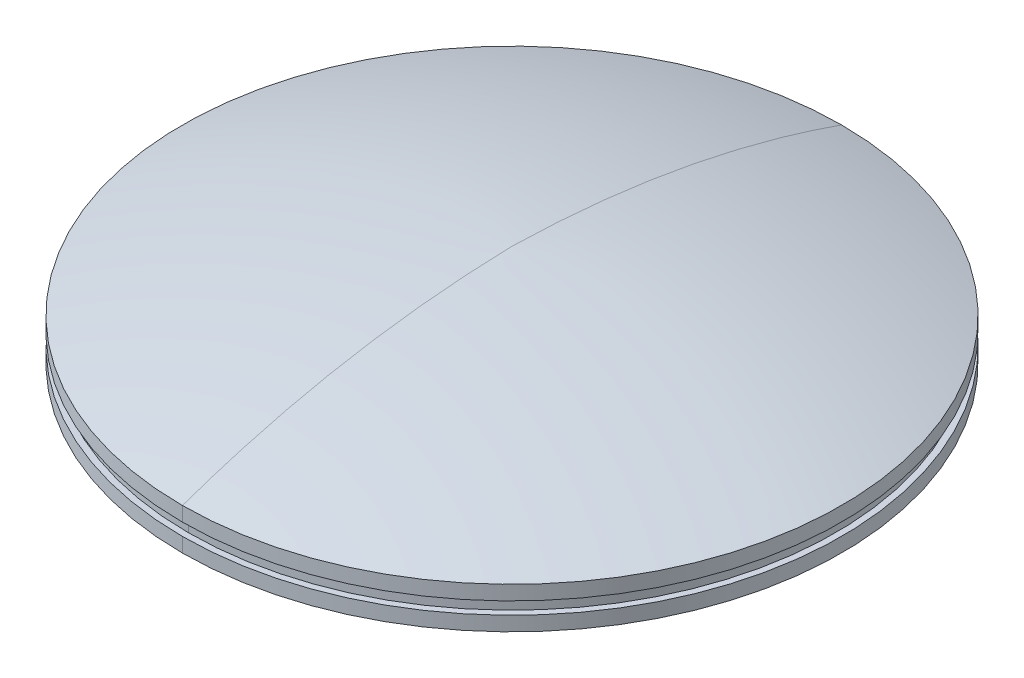
ISO-10303-21;
HEADER;
FILE_DESCRIPTION(('STEP AP214'),'2;1');
FILE_NAME('part.step','',(''),(''),'','','');
FILE_SCHEMA(('AUTOMOTIVE_DESIGN { 1 0 10303 214 1 1 1 1 }'));
ENDSEC;
DATA;
#1=APPLICATION_CONTEXT('core data for automotive mechanical design processes');
#2=APPLICATION_PROTOCOL_DEFINITION('international standard','automotive_design',2000,#1);
#3=PRODUCT_CONTEXT('',#1,'mechanical');
#4=PRODUCT('Part','Part','',(#3));
#5=PRODUCT_RELATED_PRODUCT_CATEGORY('part','',(#4));
#6=PRODUCT_DEFINITION_FORMATION('','',#4);
#7=PRODUCT_DEFINITION_CONTEXT('part definition',#1,'design');
#8=PRODUCT_DEFINITION('design','',#6,#7);
#9=PRODUCT_DEFINITION_SHAPE('','',#8);
#10=(LENGTH_UNIT() NAMED_UNIT(*) SI_UNIT(.MILLI.,.METRE.));
#11=(NAMED_UNIT(*) PLANE_ANGLE_UNIT() SI_UNIT($,.RADIAN.));
#12=(NAMED_UNIT(*) SI_UNIT($,.STERADIAN.) SOLID_ANGLE_UNIT());
#13=UNCERTAINTY_MEASURE_WITH_UNIT(LENGTH_MEASURE(1.E-05),#10,'distance_accuracy_value','');
#14=(GEOMETRIC_REPRESENTATION_CONTEXT(3) GLOBAL_UNCERTAINTY_ASSIGNED_CONTEXT((#13)) GLOBAL_UNIT_ASSIGNED_CONTEXT((#10,
#11,#12)) REPRESENTATION_CONTEXT('',''));
#15=CARTESIAN_POINT('',(0.,0.,0.));
#16=DIRECTION('',(0.,0.,1.));
#17=DIRECTION('',(1.,0.,0.));
#18=AXIS2_PLACEMENT_3D('',#15,#16,#17);
#19=CARTESIAN_POINT('',(0.,39.9,-36.1149923829614));
#20=CARTESIAN_POINT('',(0.,39.9,-36.1149923829614));
#21=CARTESIAN_POINT('',(0.,39.9,-36.1149923829614));
#22=CARTESIAN_POINT('',(0.,39.9,-36.1149923829614));
#23=CARTESIAN_POINT('',(0.,39.703769318367,-44.4473896628763));
#24=CARTESIAN_POINT('',(16.6647945598297,39.703769318367,-44.4473896628762));
#25=CARTESIAN_POINT('',(16.6647945598297,39.703769318367,-27.7825951030466));
#26=CARTESIAN_POINT('',(0.,39.703769318367,-27.7825951030466));
#27=CARTESIAN_POINT('',(0.,37.,-52.1149923829614));
#28=CARTESIAN_POINT('',(32.,37.,-52.1149923829614));
#29=CARTESIAN_POINT('',(32.,37.,-20.1149923829614));
#30=CARTESIAN_POINT('',(0.,37.,-20.1149923829614));
#31=(BOUNDED_SURFACE() B_SPLINE_SURFACE(2,3,((#19,#20,#21,#22),(#23,#24,#25,#26),(#27,#28,#29,
#30)),.UNSPECIFIED.,.F.,.F.,.F.) B_SPLINE_SURFACE_WITH_KNOTS((3,3),(4,4),(0.,1.),(0.,1.),
.UNSPECIFIED.) GEOMETRIC_REPRESENTATION_ITEM() RATIONAL_B_SPLINE_SURFACE(((1.,0.333333333333334,
0.333333333333334,1.),(1.,0.333333333333334,0.333333333333334,1.),(1.,0.333333333333334,
0.333333333333334,1.))) REPRESENTATION_ITEM('') SURFACE());
#32=CARTESIAN_POINT('',(0.,39.9,-36.1149923829614));
#33=CARTESIAN_POINT('',(0.,39.703769318367,-44.4473896628763));
#34=CARTESIAN_POINT('',(0.,37.,-52.1149923829614));
#35=(BOUNDED_CURVE() B_SPLINE_CURVE(2,(#32,#33,#34),.UNSPECIFIED.,.F.,
.F.) B_SPLINE_CURVE_WITH_KNOTS((3,3),(0.,1.),
.UNSPECIFIED.) CURVE() GEOMETRIC_REPRESENTATION_ITEM() RATIONAL_B_SPLINE_CURVE((1.,1.,1.)) REPRESENTATION_ITEM(''));
#36=CARTESIAN_POINT('',(0.,39.9,-36.1149923829614));
#37=VERTEX_POINT('',#36);
#38=CARTESIAN_POINT('',(0.,37.,-52.1149923829614));
#39=VERTEX_POINT('',#38);
#40=EDGE_CURVE('E48',#37,#39,#35,.T.);
#41=CARTESIAN_POINT('',(0.,39.9,-36.1149923829614));
#42=CARTESIAN_POINT('',(0.,39.703769318367,-27.7825951030466));
#43=CARTESIAN_POINT('',(0.,37.,-20.1149923829614));
#44=(BOUNDED_CURVE() B_SPLINE_CURVE(2,(#41,#42,#43),.UNSPECIFIED.,.F.,
.F.) B_SPLINE_CURVE_WITH_KNOTS((3,3),(0.,1.),
.UNSPECIFIED.) CURVE() GEOMETRIC_REPRESENTATION_ITEM() RATIONAL_B_SPLINE_CURVE((1.,1.,1.)) REPRESENTATION_ITEM(''));
#45=CARTESIAN_POINT('',(0.,37.,-20.1149923829614));
#46=VERTEX_POINT('',#45);
#47=EDGE_CURVE('E11',#37,#46,#44,.T.);
#48=CARTESIAN_POINT('',(0.,37.,-36.1149923829614));
#49=DIRECTION('',(0.,-1.,0.));
#50=DIRECTION('',(0.,0.,-1.));
#51=AXIS2_PLACEMENT_3D('',#48,#49,#50);
#52=CIRCLE('',#51,16.);
#53=EDGE_CURVE('E57',#39,#46,#52,.T.);
#54=ORIENTED_EDGE('',*,*,#40,.F.);
#55=ORIENTED_EDGE('',*,*,#47,.T.);
#56=ORIENTED_EDGE('',*,*,#53,.F.);
#57=EDGE_LOOP('',(#54,#55,#56));
#58=FACE_BOUND('',#57,.T.);
#59=ADVANCED_FACE('F44',(#58),#31,.F.);
#60=CARTESIAN_POINT('',(0.,30.4,-36.1149923829614));
#61=DIRECTION('',(0.,-1.,0.));
#62=DIRECTION('',(0.,0.,-1.));
#63=AXIS2_PLACEMENT_3D('',#60,#61,#62);
#64=CYLINDRICAL_SURFACE('',#63,16.);
#65=ORIENTED_EDGE('',*,*,#53,.T.);
#66=DIRECTION('',(0.,-1.,0.));
#67=VECTOR('',#66,1.);
#68=CARTESIAN_POINT('',(0.,30.4,-20.1149923829614));
#69=LINE('',#68,#67);
#70=CARTESIAN_POINT('',(0.,36.3,-20.1149923829614));
#71=VERTEX_POINT('',#70);
#72=EDGE_CURVE('E212',#46,#71,#69,.T.);
#73=ORIENTED_EDGE('',*,*,#72,.T.);
#74=CARTESIAN_POINT('',(0.,36.3,-36.1149923829614));
#75=DIRECTION('',(0.,-1.,0.));
#76=DIRECTION('',(0.,0.,-1.));
#77=AXIS2_PLACEMENT_3D('',#74,#75,#76);
#78=CIRCLE('',#77,16.);
#79=CARTESIAN_POINT('',(0.,36.3,-52.1149923829614));
#80=VERTEX_POINT('',#79);
#81=EDGE_CURVE('E191',#80,#71,#78,.T.);
#82=ORIENTED_EDGE('',*,*,#81,.F.);
#83=DIRECTION('',(0.,-1.,0.));
#84=VECTOR('',#83,1.);
#85=CARTESIAN_POINT('',(0.,30.4,-52.1149923829614));
#86=LINE('',#85,#84);
#87=EDGE_CURVE('E179',#39,#80,#86,.T.);
#88=ORIENTED_EDGE('',*,*,#87,.F.);
#89=EDGE_LOOP('',(#65,#73,#82,#88));
#90=FACE_BOUND('',#89,.T.);
#91=ADVANCED_FACE('F46',(#90),#64,.T.);
#92=CARTESIAN_POINT('',(0.,30.4,-36.1149923829614));
#93=DIRECTION('',(0.,-1.,0.));
#94=DIRECTION('',(0.,0.,-1.));
#95=AXIS2_PLACEMENT_3D('',#92,#93,#94);
#96=CYLINDRICAL_SURFACE('',#95,15.7);
#97=CARTESIAN_POINT('',(0.,36.3,-36.1149923829614));
#98=DIRECTION('',(0.,-1.,0.));
#99=DIRECTION('',(0.,0.,-1.));
#100=AXIS2_PLACEMENT_3D('',#97,#98,#99);
#101=CIRCLE('',#100,15.7);
#102=CARTESIAN_POINT('',(0.,36.3,-51.8149923829614));
#103=VERTEX_POINT('',#102);
#104=CARTESIAN_POINT('',(0.,36.3,-20.4149923829614));
#105=VERTEX_POINT('',#104);
#106=EDGE_CURVE('E217',#103,#105,#101,.T.);
#107=ORIENTED_EDGE('',*,*,#106,.T.);
#108=DIRECTION('',(0.,-1.,0.));
#109=VECTOR('',#108,1.);
#110=CARTESIAN_POINT('',(0.,30.4,-20.4149923829614));
#111=LINE('',#110,#109);
#112=CARTESIAN_POINT('',(0.,35.7,-20.4149923829614));
#113=VERTEX_POINT('',#112);
#114=EDGE_CURVE('E213',#105,#113,#111,.T.);
#115=ORIENTED_EDGE('',*,*,#114,.T.);
#116=CARTESIAN_POINT('',(0.,35.7,-36.1149923829614));
#117=DIRECTION('',(0.,-1.,0.));
#118=DIRECTION('',(0.,0.,-1.));
#119=AXIS2_PLACEMENT_3D('',#116,#117,#118);
#120=CIRCLE('',#119,15.7);
#121=CARTESIAN_POINT('',(0.,35.7,-51.8149923829614));
#122=VERTEX_POINT('',#121);
#123=EDGE_CURVE('E224',#122,#113,#120,.T.);
#124=ORIENTED_EDGE('',*,*,#123,.F.);
#125=DIRECTION('',(0.,-1.,0.));
#126=VECTOR('',#125,1.);
#127=CARTESIAN_POINT('',(0.,30.4,-51.8149923829614));
#128=LINE('',#127,#126);
#129=EDGE_CURVE('E185',#103,#122,#128,.T.);
#130=ORIENTED_EDGE('',*,*,#129,.F.);
#131=EDGE_LOOP('',(#107,#115,#124,#130));
#132=FACE_BOUND('',#131,.T.);
#133=ADVANCED_FACE('F251',(#132),#96,.T.);
#134=CARTESIAN_POINT('',(0.,30.4,-36.1149923829614));
#135=DIRECTION('',(0.,-1.,0.));
#136=DIRECTION('',(0.,0.,-1.));
#137=AXIS2_PLACEMENT_3D('',#134,#135,#136);
#138=CYLINDRICAL_SURFACE('',#137,16.);
#139=CARTESIAN_POINT('',(0.,35.7,-36.1149923829614));
#140=DIRECTION('',(0.,-1.,0.));
#141=DIRECTION('',(0.,0.,-1.));
#142=AXIS2_PLACEMENT_3D('',#139,#140,#141);
#143=CIRCLE('',#142,16.);
#144=CARTESIAN_POINT('',(0.,35.7,-52.1149923829614));
#145=VERTEX_POINT('',#144);
#146=CARTESIAN_POINT('',(0.,35.7,-20.1149923829614));
#147=VERTEX_POINT('',#146);
#148=EDGE_CURVE('E178',#145,#147,#143,.T.);
#149=ORIENTED_EDGE('',*,*,#148,.T.);
#150=DIRECTION('',(0.,-1.,0.));
#151=VECTOR('',#150,1.);
#152=CARTESIAN_POINT('',(0.,30.4,-20.1149923829614));
#153=LINE('',#152,#151);
#154=CARTESIAN_POINT('',(0.,35.,-20.1149923829614));
#155=VERTEX_POINT('',#154);
#156=EDGE_CURVE('E163',#147,#155,#153,.T.);
#157=ORIENTED_EDGE('',*,*,#156,.T.);
#158=CARTESIAN_POINT('',(0.,35.,-36.1149923829614));
#159=DIRECTION('',(0.,-1.,0.));
#160=DIRECTION('',(0.,0.,-1.));
#161=AXIS2_PLACEMENT_3D('',#158,#159,#160);
#162=CIRCLE('',#161,16.);
#163=CARTESIAN_POINT('',(0.,35.,-52.1149923829614));
#164=VERTEX_POINT('',#163);
#165=EDGE_CURVE('E155',#164,#155,#162,.T.);
#166=ORIENTED_EDGE('',*,*,#165,.F.);
#167=DIRECTION('',(0.,-1.,0.));
#168=VECTOR('',#167,1.);
#169=CARTESIAN_POINT('',(0.,30.4,-52.1149923829614));
#170=LINE('',#169,#168);
#171=EDGE_CURVE('E200',#145,#164,#170,.T.);
#172=ORIENTED_EDGE('',*,*,#171,.F.);
#173=EDGE_LOOP('',(#149,#157,#166,#172));
#174=FACE_BOUND('',#173,.T.);
#175=ADVANCED_FACE('F237',(#174),#138,.T.);
#176=CARTESIAN_POINT('',(0.,32.8,-36.1149923829614));
#177=DIRECTION('',(0.,1.,0.));
#178=DIRECTION('',(0.,0.,1.));
#179=AXIS2_PLACEMENT_3D('',#176,#177,#178);
#180=CONICAL_SURFACE('',#179,9.,1.26628544359278);
#181=CARTESIAN_POINT('',(0.,32.8,-36.1149923829614));
#182=DIRECTION('',(0.,-1.,0.));
#183=DIRECTION('',(0.,0.,-1.));
#184=AXIS2_PLACEMENT_3D('',#181,#182,#183);
#185=CIRCLE('',#184,9.);
#186=CARTESIAN_POINT('',(0.,32.8,-45.1149923829614));
#187=VERTEX_POINT('',#186);
#188=CARTESIAN_POINT('',(0.,32.8,-27.1149923829614));
#189=VERTEX_POINT('',#188);
#190=EDGE_CURVE('E132',#187,#189,#185,.T.);
#191=ORIENTED_EDGE('',*,*,#190,.F.);
#192=DIRECTION('',(0.,0.299826596740394,-0.953993716901256));
#193=VECTOR('',#192,1.);
#194=CARTESIAN_POINT('',(0.,32.8,-45.1149923829614));
#195=LINE('',#194,#193);
#196=EDGE_CURVE('E137',#187,#164,#195,.T.);
#197=ORIENTED_EDGE('',*,*,#196,.T.);
#198=ORIENTED_EDGE('',*,*,#165,.T.);
#199=DIRECTION('',(0.,0.299826596740394,0.953993716901256));
#200=VECTOR('',#199,1.);
#201=CARTESIAN_POINT('',(0.,32.8,-27.1149923829614));
#202=LINE('',#201,#200);
#203=EDGE_CURVE('E139',#189,#155,#202,.T.);
#204=ORIENTED_EDGE('',*,*,#203,.F.);
#205=EDGE_LOOP('',(#191,#197,#198,#204));
#206=FACE_BOUND('',#205,.T.);
#207=ADVANCED_FACE('F134',(#206),#180,.T.);
#208=CARTESIAN_POINT('',(0.,30.4,-36.1149923829614));
#209=DIRECTION('',(0.,1.,0.));
#210=DIRECTION('',(0.,0.,1.));
#211=AXIS2_PLACEMENT_3D('',#208,#209,#210);
#212=CONICAL_SURFACE('',#211,7.,0.694738276196703);
#213=CARTESIAN_POINT('',(0.,30.4,-36.1149923829614));
#214=DIRECTION('',(0.,-1.,0.));
#215=DIRECTION('',(0.,0.,-1.));
#216=AXIS2_PLACEMENT_3D('',#213,#214,#215);
#217=CIRCLE('',#216,7.);
#218=CARTESIAN_POINT('',(0.,30.4,-43.1149923829614));
#219=VERTEX_POINT('',#218);
#220=CARTESIAN_POINT('',(0.,30.4,-29.1149923829614));
#221=VERTEX_POINT('',#220);
#222=EDGE_CURVE('E149',#219,#221,#217,.T.);
#223=ORIENTED_EDGE('',*,*,#222,.F.);
#224=DIRECTION('',(0.,0.768221279597376,-0.64018439966448));
#225=VECTOR('',#224,1.);
#226=CARTESIAN_POINT('',(0.,30.4,-43.1149923829614));
#227=LINE('',#226,#225);
#228=EDGE_CURVE('E144',#219,#187,#227,.T.);
#229=ORIENTED_EDGE('',*,*,#228,.T.);
#230=ORIENTED_EDGE('',*,*,#190,.T.);
#231=DIRECTION('',(0.,0.768221279597376,0.64018439966448));
#232=VECTOR('',#231,1.);
#233=CARTESIAN_POINT('',(0.,30.4,-29.1149923829614));
#234=LINE('',#233,#232);
#235=EDGE_CURVE('E166',#221,#189,#234,.T.);
#236=ORIENTED_EDGE('',*,*,#235,.F.);
#237=EDGE_LOOP('',(#223,#229,#230,#236));
#238=FACE_BOUND('',#237,.T.);
#239=ADVANCED_FACE('F147',(#238),#212,.T.);
#240=CARTESIAN_POINT('',(0.,39.9,-36.1149923829614));
#241=CARTESIAN_POINT('',(0.,39.9,-36.1149923829614));
#242=CARTESIAN_POINT('',(0.,39.9,-36.1149923829614));
#243=CARTESIAN_POINT('',(0.,39.9,-36.1149923829614));
#244=CARTESIAN_POINT('',(0.,39.703769318367,-27.7825951030466));
#245=CARTESIAN_POINT('',(-16.6647945598297,39.703769318367,-27.7825951030466));
#246=CARTESIAN_POINT('',(-16.6647945598297,39.703769318367,-44.4473896628762));
#247=CARTESIAN_POINT('',(0.,39.703769318367,-44.4473896628763));
#248=CARTESIAN_POINT('',(0.,37.,-20.1149923829614));
#249=CARTESIAN_POINT('',(-32.,37.,-20.1149923829614));
#250=CARTESIAN_POINT('',(-32.,37.,-52.1149923829614));
#251=CARTESIAN_POINT('',(0.,37.,-52.1149923829614));
#252=(BOUNDED_SURFACE() B_SPLINE_SURFACE(2,3,((#240,#241,#242,#243),(#244,#245,#246,#247),(#248,
#249,#250,#251)),.UNSPECIFIED.,.F.,.F.,.F.) B_SPLINE_SURFACE_WITH_KNOTS((3,3),(4,4),(0.,1.),(0.,
1.),.UNSPECIFIED.) GEOMETRIC_REPRESENTATION_ITEM() RATIONAL_B_SPLINE_SURFACE(((1.,
0.333333333333334,0.333333333333334,1.),(1.,0.333333333333334,0.333333333333334,1.),(1.,
0.333333333333334,0.333333333333334,1.))) REPRESENTATION_ITEM('') SURFACE());
#253=CARTESIAN_POINT('',(0.,37.,-36.1149923829614));
#254=DIRECTION('',(0.,-1.,0.));
#255=DIRECTION('',(0.,0.,-1.));
#256=AXIS2_PLACEMENT_3D('',#253,#254,#255);
#257=CIRCLE('',#256,16.);
#258=EDGE_CURVE('E181',#46,#39,#257,.T.);
#259=ORIENTED_EDGE('',*,*,#47,.F.);
#260=ORIENTED_EDGE('',*,*,#40,.T.);
#261=ORIENTED_EDGE('',*,*,#258,.F.);
#262=EDGE_LOOP('',(#259,#260,#261));
#263=FACE_BOUND('',#262,.T.);
#264=ADVANCED_FACE('F272',(#263),#252,.F.);
#265=CARTESIAN_POINT('',(0.,30.4,0.));
#266=DIRECTION('',(0.,-1.,0.));
#267=DIRECTION('',(0.,0.,-1.));
#268=AXIS2_PLACEMENT_3D('',#265,#266,#267);
#269=PLANE('',#268);
#270=CARTESIAN_POINT('',(0.,30.4,-36.1149923829614));
#271=DIRECTION('',(0.,-1.,0.));
#272=DIRECTION('',(0.,0.,-1.));
#273=AXIS2_PLACEMENT_3D('',#270,#271,#272);
#274=CIRCLE('',#273,7.);
#275=EDGE_CURVE('E206',#221,#219,#274,.T.);
#276=ORIENTED_EDGE('',*,*,#275,.T.);
#277=ORIENTED_EDGE('',*,*,#222,.T.);
#278=EDGE_LOOP('',(#276,#277));
#279=FACE_BOUND('',#278,.T.);
#280=ADVANCED_FACE('F270',(#279),#269,.T.);
#281=CARTESIAN_POINT('',(0.,30.4,-36.1149923829614));
#282=DIRECTION('',(0.,1.,0.));
#283=DIRECTION('',(0.,0.,1.));
#284=AXIS2_PLACEMENT_3D('',#281,#282,#283);
#285=CONICAL_SURFACE('',#284,7.,0.694738276196703);
#286=ORIENTED_EDGE('',*,*,#228,.F.);
#287=ORIENTED_EDGE('',*,*,#275,.F.);
#288=ORIENTED_EDGE('',*,*,#235,.T.);
#289=CARTESIAN_POINT('',(0.,32.8,-36.1149923829614));
#290=DIRECTION('',(0.,-1.,0.));
#291=DIRECTION('',(0.,0.,-1.));
#292=AXIS2_PLACEMENT_3D('',#289,#290,#291);
#293=CIRCLE('',#292,9.);
#294=EDGE_CURVE('E159',#189,#187,#293,.T.);
#295=ORIENTED_EDGE('',*,*,#294,.T.);
#296=EDGE_LOOP('',(#286,#287,#288,#295));
#297=FACE_BOUND('',#296,.T.);
#298=ADVANCED_FACE('F165',(#297),#285,.T.);
#299=CARTESIAN_POINT('',(0.,32.8,-36.1149923829614));
#300=DIRECTION('',(0.,1.,0.));
#301=DIRECTION('',(0.,0.,1.));
#302=AXIS2_PLACEMENT_3D('',#299,#300,#301);
#303=CONICAL_SURFACE('',#302,9.,1.26628544359278);
#304=ORIENTED_EDGE('',*,*,#196,.F.);
#305=ORIENTED_EDGE('',*,*,#294,.F.);
#306=ORIENTED_EDGE('',*,*,#203,.T.);
#307=CARTESIAN_POINT('',(0.,35.,-36.1149923829614));
#308=DIRECTION('',(0.,-1.,0.));
#309=DIRECTION('',(0.,0.,-1.));
#310=AXIS2_PLACEMENT_3D('',#307,#308,#309);
#311=CIRCLE('',#310,16.);
#312=EDGE_CURVE('E161',#155,#164,#311,.T.);
#313=ORIENTED_EDGE('',*,*,#312,.T.);
#314=EDGE_LOOP('',(#304,#305,#306,#313));
#315=FACE_BOUND('',#314,.T.);
#316=ADVANCED_FACE('F158',(#315),#303,.T.);
#317=CARTESIAN_POINT('',(0.,30.4,-36.1149923829614));
#318=DIRECTION('',(0.,-1.,0.));
#319=DIRECTION('',(0.,0.,-1.));
#320=AXIS2_PLACEMENT_3D('',#317,#318,#319);
#321=CYLINDRICAL_SURFACE('',#320,16.);
#322=ORIENTED_EDGE('',*,*,#156,.F.);
#323=CARTESIAN_POINT('',(0.,35.7,-36.1149923829614));
#324=DIRECTION('',(0.,-1.,0.));
#325=DIRECTION('',(0.,0.,-1.));
#326=AXIS2_PLACEMENT_3D('',#323,#324,#325);
#327=CIRCLE('',#326,16.);
#328=EDGE_CURVE('E196',#147,#145,#327,.T.);
#329=ORIENTED_EDGE('',*,*,#328,.T.);
#330=ORIENTED_EDGE('',*,*,#171,.T.);
#331=ORIENTED_EDGE('',*,*,#312,.F.);
#332=EDGE_LOOP('',(#322,#329,#330,#331));
#333=FACE_BOUND('',#332,.T.);
#334=ADVANCED_FACE('F232',(#333),#321,.T.);
#335=CARTESIAN_POINT('',(0.,35.7,0.));
#336=DIRECTION('',(0.,1.,0.));
#337=DIRECTION('',(1.,0.,0.));
#338=AXIS2_PLACEMENT_3D('',#335,#336,#337);
#339=PLANE('',#338);
#340=ORIENTED_EDGE('',*,*,#148,.F.);
#341=ORIENTED_EDGE('',*,*,#328,.F.);
#342=EDGE_LOOP('',(#340,#341));
#343=FACE_BOUND('',#342,.T.);
#344=ORIENTED_EDGE('',*,*,#123,.T.);
#345=CARTESIAN_POINT('',(0.,35.7,-36.1149923829614));
#346=DIRECTION('',(0.,-1.,0.));
#347=DIRECTION('',(0.,0.,-1.));
#348=AXIS2_PLACEMENT_3D('',#345,#346,#347);
#349=CIRCLE('',#348,15.7);
#350=EDGE_CURVE('E226',#113,#122,#349,.T.);
#351=ORIENTED_EDGE('',*,*,#350,.T.);
#352=EDGE_LOOP('',(#344,#351));
#353=FACE_BOUND('',#352,.T.);
#354=ADVANCED_FACE('F241',(#343,#353),#339,.T.);
#355=CARTESIAN_POINT('',(0.,30.4,-36.1149923829614));
#356=DIRECTION('',(0.,-1.,0.));
#357=DIRECTION('',(0.,0.,-1.));
#358=AXIS2_PLACEMENT_3D('',#355,#356,#357);
#359=CYLINDRICAL_SURFACE('',#358,15.7);
#360=ORIENTED_EDGE('',*,*,#114,.F.);
#361=CARTESIAN_POINT('',(0.,36.3,-36.1149923829614));
#362=DIRECTION('',(0.,-1.,0.));
#363=DIRECTION('',(0.,0.,-1.));
#364=AXIS2_PLACEMENT_3D('',#361,#362,#363);
#365=CIRCLE('',#364,15.7);
#366=EDGE_CURVE('E190',#105,#103,#365,.T.);
#367=ORIENTED_EDGE('',*,*,#366,.T.);
#368=ORIENTED_EDGE('',*,*,#129,.T.);
#369=ORIENTED_EDGE('',*,*,#350,.F.);
#370=EDGE_LOOP('',(#360,#367,#368,#369));
#371=FACE_BOUND('',#370,.T.);
#372=ADVANCED_FACE('F244',(#371),#359,.T.);
#373=CARTESIAN_POINT('',(0.,36.3,0.));
#374=DIRECTION('',(0.,1.,0.));
#375=DIRECTION('',(1.,0.,0.));
#376=AXIS2_PLACEMENT_3D('',#373,#374,#375);
#377=PLANE('',#376);
#378=ORIENTED_EDGE('',*,*,#81,.T.);
#379=CARTESIAN_POINT('',(0.,36.3,-36.1149923829614));
#380=DIRECTION('',(0.,-1.,0.));
#381=DIRECTION('',(0.,0.,-1.));
#382=AXIS2_PLACEMENT_3D('',#379,#380,#381);
#383=CIRCLE('',#382,16.);
#384=EDGE_CURVE('E195',#71,#80,#383,.T.);
#385=ORIENTED_EDGE('',*,*,#384,.T.);
#386=EDGE_LOOP('',(#378,#385));
#387=FACE_BOUND('',#386,.T.);
#388=ORIENTED_EDGE('',*,*,#106,.F.);
#389=ORIENTED_EDGE('',*,*,#366,.F.);
#390=EDGE_LOOP('',(#388,#389));
#391=FACE_BOUND('',#390,.T.);
#392=ADVANCED_FACE('F298',(#387,#391),#377,.F.);
#393=CARTESIAN_POINT('',(0.,30.4,-36.1149923829614));
#394=DIRECTION('',(0.,-1.,0.));
#395=DIRECTION('',(0.,0.,-1.));
#396=AXIS2_PLACEMENT_3D('',#393,#394,#395);
#397=CYLINDRICAL_SURFACE('',#396,16.);
#398=ORIENTED_EDGE('',*,*,#72,.F.);
#399=ORIENTED_EDGE('',*,*,#258,.T.);
#400=ORIENTED_EDGE('',*,*,#87,.T.);
#401=ORIENTED_EDGE('',*,*,#384,.F.);
#402=EDGE_LOOP('',(#398,#399,#400,#401));
#403=FACE_BOUND('',#402,.T.);
#404=ADVANCED_FACE('F302',(#403),#397,.T.);
#405=CLOSED_SHELL('',(#59,#91,#133,#175,#207,#239,#264,#280,#298,#316,#334,#354,#372,#392,#404));
#406=MANIFOLD_SOLID_BREP('B2',#405);
#407=ADVANCED_BREP_SHAPE_REPRESENTATION('',(#18,#406),#14);
#408=SHAPE_DEFINITION_REPRESENTATION(#9,#407);
ENDSEC;
END-ISO-10303-21;
